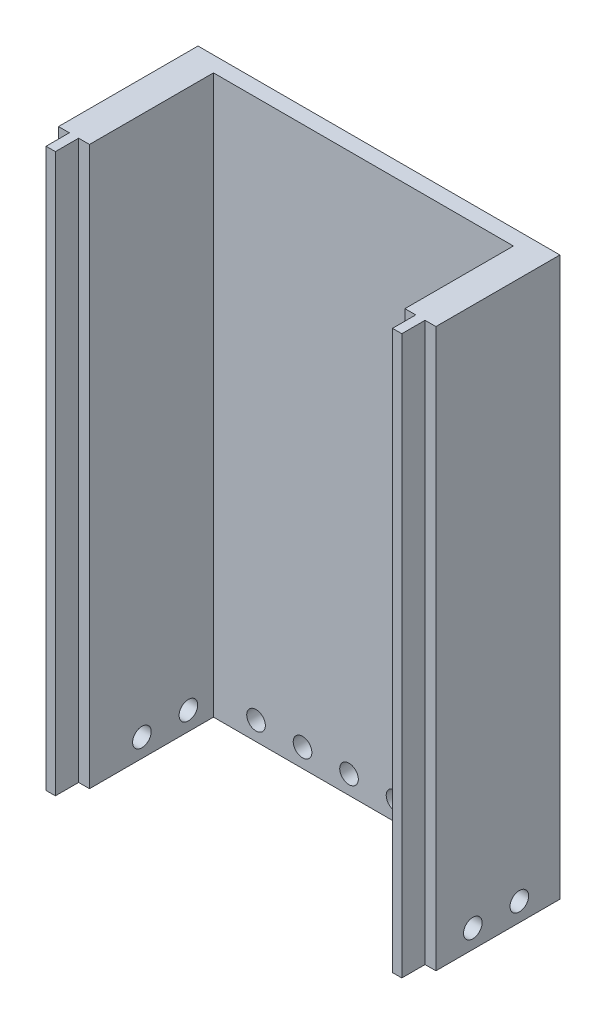
ISO-10303-21;
HEADER;
FILE_DESCRIPTION(('STEP AP214'),'2;1');
FILE_NAME('part.step','',(''),(''),'','','');
FILE_SCHEMA(('AUTOMOTIVE_DESIGN { 1 0 10303 214 1 1 1 1 }'));
ENDSEC;
DATA;
#1=APPLICATION_CONTEXT('core data for automotive mechanical design processes');
#2=APPLICATION_PROTOCOL_DEFINITION('international standard','automotive_design',2000,#1);
#3=PRODUCT_CONTEXT('',#1,'mechanical');
#4=PRODUCT('Part','Part','',(#3));
#5=PRODUCT_RELATED_PRODUCT_CATEGORY('part','',(#4));
#6=PRODUCT_DEFINITION_FORMATION('','',#4);
#7=PRODUCT_DEFINITION_CONTEXT('part definition',#1,'design');
#8=PRODUCT_DEFINITION('design','',#6,#7);
#9=PRODUCT_DEFINITION_SHAPE('','',#8);
#10=(LENGTH_UNIT() NAMED_UNIT(*) SI_UNIT(.MILLI.,.METRE.));
#11=(NAMED_UNIT(*) PLANE_ANGLE_UNIT() SI_UNIT($,.RADIAN.));
#12=(NAMED_UNIT(*) SI_UNIT($,.STERADIAN.) SOLID_ANGLE_UNIT());
#13=UNCERTAINTY_MEASURE_WITH_UNIT(LENGTH_MEASURE(1.E-05),#10,'distance_accuracy_value','');
#14=(GEOMETRIC_REPRESENTATION_CONTEXT(3) GLOBAL_UNCERTAINTY_ASSIGNED_CONTEXT((#13)) GLOBAL_UNIT_ASSIGNED_CONTEXT((#10,
#11,#12)) REPRESENTATION_CONTEXT('',''));
#15=CARTESIAN_POINT('',(0.,0.,0.));
#16=DIRECTION('',(0.,0.,1.));
#17=DIRECTION('',(1.,0.,0.));
#18=AXIS2_PLACEMENT_3D('',#15,#16,#17);
#19=CARTESIAN_POINT('',(-8.37229615598452,18.,12.1908698498439));
#20=DIRECTION('',(0.,0.,1.));
#21=DIRECTION('',(1.,0.,0.));
#22=AXIS2_PLACEMENT_3D('',#19,#20,#21);
#23=PLANE('',#22);
#24=CARTESIAN_POINT('',(-4.5,0.6,12.1908698498439));
#25=DIRECTION('',(0.,0.,1.));
#26=DIRECTION('',(1.,0.,0.));
#27=AXIS2_PLACEMENT_3D('',#24,#25,#26);
#28=CIRCLE('',#27,0.3);
#29=CARTESIAN_POINT('',(-4.2,0.6,12.1908698498439));
#30=VERTEX_POINT('',#29);
#31=EDGE_CURVE('E318',#30,#30,#28,.T.);
#32=ORIENTED_EDGE('',*,*,#31,.T.);
#33=EDGE_LOOP('',(#32));
#34=FACE_BOUND('',#33,.T.);
#35=CARTESIAN_POINT('',(-3.,0.6,12.1908698498439));
#36=DIRECTION('',(0.,0.,1.));
#37=DIRECTION('',(1.,0.,0.));
#38=AXIS2_PLACEMENT_3D('',#35,#36,#37);
#39=CIRCLE('',#38,0.3);
#40=CARTESIAN_POINT('',(-2.7,0.6,12.1908698498439));
#41=VERTEX_POINT('',#40);
#42=EDGE_CURVE('E322',#41,#41,#39,.T.);
#43=ORIENTED_EDGE('',*,*,#42,.T.);
#44=EDGE_LOOP('',(#43));
#45=FACE_BOUND('',#44,.T.);
#46=CARTESIAN_POINT('',(-1.5,0.6,12.1908698498439));
#47=DIRECTION('',(0.,0.,1.));
#48=DIRECTION('',(1.,0.,0.));
#49=AXIS2_PLACEMENT_3D('',#46,#47,#48);
#50=CIRCLE('',#49,0.3);
#51=CARTESIAN_POINT('',(-1.2,0.6,12.1908698498439));
#52=VERTEX_POINT('',#51);
#53=EDGE_CURVE('E326',#52,#52,#50,.T.);
#54=ORIENTED_EDGE('',*,*,#53,.T.);
#55=EDGE_LOOP('',(#54));
#56=FACE_BOUND('',#55,.T.);
#57=CARTESIAN_POINT('',(1.5,0.6,12.1908698498439));
#58=DIRECTION('',(0.,0.,1.));
#59=DIRECTION('',(1.,0.,0.));
#60=AXIS2_PLACEMENT_3D('',#57,#58,#59);
#61=CIRCLE('',#60,0.3);
#62=CARTESIAN_POINT('',(1.8,0.6,12.1908698498439));
#63=VERTEX_POINT('',#62);
#64=EDGE_CURVE('E330',#63,#63,#61,.T.);
#65=ORIENTED_EDGE('',*,*,#64,.T.);
#66=EDGE_LOOP('',(#65));
#67=FACE_BOUND('',#66,.T.);
#68=CARTESIAN_POINT('',(0.,0.6,12.1908698498439));
#69=DIRECTION('',(0.,0.,1.));
#70=DIRECTION('',(1.,0.,0.));
#71=AXIS2_PLACEMENT_3D('',#68,#69,#70);
#72=CIRCLE('',#71,0.3);
#73=CARTESIAN_POINT('',(0.3,0.6,12.1908698498439));
#74=VERTEX_POINT('',#73);
#75=EDGE_CURVE('E334',#74,#74,#72,.T.);
#76=ORIENTED_EDGE('',*,*,#75,.T.);
#77=EDGE_LOOP('',(#76));
#78=FACE_BOUND('',#77,.T.);
#79=CARTESIAN_POINT('',(-6.,0.6,12.1908698498439));
#80=DIRECTION('',(0.,0.,1.));
#81=DIRECTION('',(1.,0.,0.));
#82=AXIS2_PLACEMENT_3D('',#79,#80,#81);
#83=CIRCLE('',#82,0.3);
#84=CARTESIAN_POINT('',(-5.7,0.6,12.1908698498439));
#85=VERTEX_POINT('',#84);
#86=EDGE_CURVE('E181',#85,#85,#83,.T.);
#87=ORIENTED_EDGE('',*,*,#86,.T.);
#88=EDGE_LOOP('',(#87));
#89=FACE_BOUND('',#88,.T.);
#90=DIRECTION('',(-1.,0.,0.));
#91=VECTOR('',#90,1.);
#92=CARTESIAN_POINT('',(-8.37229615598452,0.,12.1908698498439));
#93=LINE('',#92,#91);
#94=CARTESIAN_POINT('',(3.30270384499531,0.,12.1908698498439));
#95=VERTEX_POINT('',#94);
#96=CARTESIAN_POINT('',(-8.37229615598452,0.,12.1908698498439));
#97=VERTEX_POINT('',#96);
#98=EDGE_CURVE('E177',#95,#97,#93,.T.);
#99=ORIENTED_EDGE('',*,*,#98,.T.);
#100=DIRECTION('',(0.,-1.,0.));
#101=VECTOR('',#100,1.);
#102=CARTESIAN_POINT('',(-8.37229615598452,18.,12.1908698498439));
#103=LINE('',#102,#101);
#104=CARTESIAN_POINT('',(-8.37229615598452,18.,12.1908698498439));
#105=VERTEX_POINT('',#104);
#106=EDGE_CURVE('E11',#105,#97,#103,.T.);
#107=ORIENTED_EDGE('',*,*,#106,.F.);
#108=DIRECTION('',(-1.,0.,0.));
#109=VECTOR('',#108,1.);
#110=CARTESIAN_POINT('',(-8.37229615598452,18.,12.1908698498439));
#111=LINE('',#110,#109);
#112=CARTESIAN_POINT('',(3.30270384499531,18.,12.1908698498439));
#113=VERTEX_POINT('',#112);
#114=EDGE_CURVE('E208',#113,#105,#111,.T.);
#115=ORIENTED_EDGE('',*,*,#114,.F.);
#116=DIRECTION('',(0.,-1.,0.));
#117=VECTOR('',#116,1.);
#118=CARTESIAN_POINT('',(3.30270384499531,18.,12.1908698498439));
#119=LINE('',#118,#117);
#120=EDGE_CURVE('E173',#113,#95,#119,.T.);
#121=ORIENTED_EDGE('',*,*,#120,.T.);
#122=EDGE_LOOP('',(#99,#107,#115,#121));
#123=FACE_BOUND('',#122,.T.);
#124=ADVANCED_FACE('F33',(#34,#45,#56,#67,#78,#89,#123),#23,.F.);
#125=CARTESIAN_POINT('',(-8.37229615598452,18.,12.1908698498439));
#126=DIRECTION('',(1.,0.,0.));
#127=DIRECTION('',(0.,0.,-1.));
#128=AXIS2_PLACEMENT_3D('',#125,#126,#127);
#129=PLANE('',#128);
#130=CARTESIAN_POINT('',(-8.37229615598452,0.6,13.5));
#131=DIRECTION('',(1.,0.,0.));
#132=DIRECTION('',(0.,0.,-1.));
#133=AXIS2_PLACEMENT_3D('',#130,#131,#132);
#134=CIRCLE('',#133,0.3);
#135=CARTESIAN_POINT('',(-8.37229615598452,0.6,13.2));
#136=VERTEX_POINT('',#135);
#137=EDGE_CURVE('E383',#136,#136,#134,.T.);
#138=ORIENTED_EDGE('',*,*,#137,.T.);
#139=EDGE_LOOP('',(#138));
#140=FACE_BOUND('',#139,.T.);
#141=CARTESIAN_POINT('',(-8.37229615598452,0.6,15.));
#142=DIRECTION('',(1.,0.,0.));
#143=DIRECTION('',(0.,0.,-1.));
#144=AXIS2_PLACEMENT_3D('',#141,#142,#143);
#145=CIRCLE('',#144,0.3);
#146=CARTESIAN_POINT('',(-8.37229615598452,0.6,14.7));
#147=VERTEX_POINT('',#146);
#148=EDGE_CURVE('E371',#147,#147,#145,.T.);
#149=ORIENTED_EDGE('',*,*,#148,.T.);
#150=EDGE_LOOP('',(#149));
#151=FACE_BOUND('',#150,.T.);
#152=DIRECTION('',(0.,0.,1.));
#153=VECTOR('',#152,1.);
#154=CARTESIAN_POINT('',(-8.37229615598452,0.,12.1908698498439));
#155=LINE('',#154,#153);
#156=CARTESIAN_POINT('',(-8.37229615598452,0.,16.6908698498439));
#157=VERTEX_POINT('',#156);
#158=EDGE_CURVE('E180',#97,#157,#155,.T.);
#159=ORIENTED_EDGE('',*,*,#158,.T.);
#160=DIRECTION('',(0.,-1.,0.));
#161=VECTOR('',#160,1.);
#162=CARTESIAN_POINT('',(-8.37229615598452,18.,16.6908698498439));
#163=LINE('',#162,#161);
#164=CARTESIAN_POINT('',(-8.37229615598452,18.,16.6908698498439));
#165=VERTEX_POINT('',#164);
#166=EDGE_CURVE('E41',#165,#157,#163,.T.);
#167=ORIENTED_EDGE('',*,*,#166,.F.);
#168=DIRECTION('',(0.,0.,1.));
#169=VECTOR('',#168,1.);
#170=CARTESIAN_POINT('',(-8.37229615598452,18.,12.1908698498439));
#171=LINE('',#170,#169);
#172=EDGE_CURVE('E116',#105,#165,#171,.T.);
#173=ORIENTED_EDGE('',*,*,#172,.F.);
#174=ORIENTED_EDGE('',*,*,#106,.T.);
#175=EDGE_LOOP('',(#159,#167,#173,#174));
#176=FACE_BOUND('',#175,.T.);
#177=ADVANCED_FACE('F309',(#140,#151,#176),#129,.F.);
#178=CARTESIAN_POINT('',(-8.37229615598452,18.,16.6908698498439));
#179=DIRECTION('',(0.,0.,-1.));
#180=DIRECTION('',(-1.,0.,0.));
#181=AXIS2_PLACEMENT_3D('',#178,#179,#180);
#182=PLANE('',#181);
#183=DIRECTION('',(1.,0.,0.));
#184=VECTOR('',#183,1.);
#185=CARTESIAN_POINT('',(-8.37229615598452,0.,16.6908698498439));
#186=LINE('',#185,#184);
#187=CARTESIAN_POINT('',(-8.02229615598452,0.,16.6908698498439));
#188=VERTEX_POINT('',#187);
#189=EDGE_CURVE('E183',#157,#188,#186,.T.);
#190=ORIENTED_EDGE('',*,*,#189,.T.);
#191=DIRECTION('',(0.,-1.,0.));
#192=VECTOR('',#191,1.);
#193=CARTESIAN_POINT('',(-8.02229615598452,18.,16.6908698498439));
#194=LINE('',#193,#192);
#195=CARTESIAN_POINT('',(-8.02229615598452,18.,16.6908698498439));
#196=VERTEX_POINT('',#195);
#197=EDGE_CURVE('E239',#196,#188,#194,.T.);
#198=ORIENTED_EDGE('',*,*,#197,.F.);
#199=DIRECTION('',(1.,0.,0.));
#200=VECTOR('',#199,1.);
#201=CARTESIAN_POINT('',(-8.37229615598452,18.,16.6908698498439));
#202=LINE('',#201,#200);
#203=EDGE_CURVE('E247',#165,#196,#202,.T.);
#204=ORIENTED_EDGE('',*,*,#203,.F.);
#205=ORIENTED_EDGE('',*,*,#166,.T.);
#206=EDGE_LOOP('',(#190,#198,#204,#205));
#207=FACE_BOUND('',#206,.T.);
#208=ADVANCED_FACE('F245',(#207),#182,.F.);
#209=CARTESIAN_POINT('',(-8.02229615598452,18.,16.6908698498439));
#210=DIRECTION('',(1.,0.,0.));
#211=DIRECTION('',(0.,0.,-1.));
#212=AXIS2_PLACEMENT_3D('',#209,#210,#211);
#213=PLANE('',#212);
#214=DIRECTION('',(0.,0.,1.));
#215=VECTOR('',#214,1.);
#216=CARTESIAN_POINT('',(-8.02229615598452,0.,16.6908698498439));
#217=LINE('',#216,#215);
#218=CARTESIAN_POINT('',(-8.02229615598452,0.,17.4408698498439));
#219=VERTEX_POINT('',#218);
#220=EDGE_CURVE('E185',#188,#219,#217,.T.);
#221=ORIENTED_EDGE('',*,*,#220,.T.);
#222=DIRECTION('',(0.,-1.,0.));
#223=VECTOR('',#222,1.);
#224=CARTESIAN_POINT('',(-8.02229615598452,18.,17.4408698498439));
#225=LINE('',#224,#223);
#226=CARTESIAN_POINT('',(-8.02229615598452,18.,17.4408698498439));
#227=VERTEX_POINT('',#226);
#228=EDGE_CURVE('E236',#227,#219,#225,.T.);
#229=ORIENTED_EDGE('',*,*,#228,.F.);
#230=DIRECTION('',(0.,0.,1.));
#231=VECTOR('',#230,1.);
#232=CARTESIAN_POINT('',(-8.02229615598452,18.,16.6908698498439));
#233=LINE('',#232,#231);
#234=EDGE_CURVE('E265',#196,#227,#233,.T.);
#235=ORIENTED_EDGE('',*,*,#234,.F.);
#236=ORIENTED_EDGE('',*,*,#197,.T.);
#237=EDGE_LOOP('',(#221,#229,#235,#236));
#238=FACE_BOUND('',#237,.T.);
#239=ADVANCED_FACE('F256',(#238),#213,.F.);
#240=CARTESIAN_POINT('',(-8.02229615598452,18.,17.4408698498439));
#241=DIRECTION('',(0.,0.,-1.));
#242=DIRECTION('',(-1.,0.,0.));
#243=AXIS2_PLACEMENT_3D('',#240,#241,#242);
#244=PLANE('',#243);
#245=DIRECTION('',(1.,0.,0.));
#246=VECTOR('',#245,1.);
#247=CARTESIAN_POINT('',(-8.02229615598452,0.,17.4408698498439));
#248=LINE('',#247,#246);
#249=CARTESIAN_POINT('',(-7.72229615598452,0.,17.4408698498439));
#250=VERTEX_POINT('',#249);
#251=EDGE_CURVE('E187',#219,#250,#248,.T.);
#252=ORIENTED_EDGE('',*,*,#251,.T.);
#253=DIRECTION('',(0.,-1.,0.));
#254=VECTOR('',#253,1.);
#255=CARTESIAN_POINT('',(-7.72229615598452,18.,17.4408698498439));
#256=LINE('',#255,#254);
#257=CARTESIAN_POINT('',(-7.72229615598452,18.,17.4408698498439));
#258=VERTEX_POINT('',#257);
#259=EDGE_CURVE('E233',#258,#250,#256,.T.);
#260=ORIENTED_EDGE('',*,*,#259,.F.);
#261=DIRECTION('',(1.,0.,0.));
#262=VECTOR('',#261,1.);
#263=CARTESIAN_POINT('',(-8.02229615598452,18.,17.4408698498439));
#264=LINE('',#263,#262);
#265=EDGE_CURVE('E262',#227,#258,#264,.T.);
#266=ORIENTED_EDGE('',*,*,#265,.F.);
#267=ORIENTED_EDGE('',*,*,#228,.T.);
#268=EDGE_LOOP('',(#252,#260,#266,#267));
#269=FACE_BOUND('',#268,.T.);
#270=ADVANCED_FACE('F260',(#269),#244,.F.);
#271=CARTESIAN_POINT('',(-7.72229615598452,18.,17.4408698498439));
#272=DIRECTION('',(-1.,0.,0.));
#273=DIRECTION('',(0.,0.,1.));
#274=AXIS2_PLACEMENT_3D('',#271,#272,#273);
#275=PLANE('',#274);
#276=DIRECTION('',(0.,0.,-1.));
#277=VECTOR('',#276,1.);
#278=CARTESIAN_POINT('',(-7.72229615598452,0.,17.4408698498439));
#279=LINE('',#278,#277);
#280=CARTESIAN_POINT('',(-7.72229615598452,0.,16.6908698498439));
#281=VERTEX_POINT('',#280);
#282=EDGE_CURVE('E189',#250,#281,#279,.T.);
#283=ORIENTED_EDGE('',*,*,#282,.T.);
#284=DIRECTION('',(0.,-1.,0.));
#285=VECTOR('',#284,1.);
#286=CARTESIAN_POINT('',(-7.72229615598452,18.,16.6908698498439));
#287=LINE('',#286,#285);
#288=CARTESIAN_POINT('',(-7.72229615598452,18.,16.6908698498439));
#289=VERTEX_POINT('',#288);
#290=EDGE_CURVE('E230',#289,#281,#287,.T.);
#291=ORIENTED_EDGE('',*,*,#290,.F.);
#292=DIRECTION('',(0.,0.,-1.));
#293=VECTOR('',#292,1.);
#294=CARTESIAN_POINT('',(-7.72229615598452,18.,17.4408698498439));
#295=LINE('',#294,#293);
#296=EDGE_CURVE('E264',#258,#289,#295,.T.);
#297=ORIENTED_EDGE('',*,*,#296,.F.);
#298=ORIENTED_EDGE('',*,*,#259,.T.);
#299=EDGE_LOOP('',(#283,#291,#297,#298));
#300=FACE_BOUND('',#299,.T.);
#301=ADVANCED_FACE('F439',(#300),#275,.F.);
#302=CARTESIAN_POINT('',(-7.72229615598452,18.,16.6908698498439));
#303=DIRECTION('',(0.,0.,-1.));
#304=DIRECTION('',(-1.,0.,0.));
#305=AXIS2_PLACEMENT_3D('',#302,#303,#304);
#306=PLANE('',#305);
#307=DIRECTION('',(1.,0.,0.));
#308=VECTOR('',#307,1.);
#309=CARTESIAN_POINT('',(-7.72229615598452,0.,16.6908698498439));
#310=LINE('',#309,#308);
#311=CARTESIAN_POINT('',(-7.37229615598452,0.,16.6908698498439));
#312=VERTEX_POINT('',#311);
#313=EDGE_CURVE('E191',#281,#312,#310,.T.);
#314=ORIENTED_EDGE('',*,*,#313,.T.);
#315=DIRECTION('',(0.,-1.,0.));
#316=VECTOR('',#315,1.);
#317=CARTESIAN_POINT('',(-7.37229615598452,18.,16.6908698498439));
#318=LINE('',#317,#316);
#319=CARTESIAN_POINT('',(-7.37229615598452,18.,16.6908698498439));
#320=VERTEX_POINT('',#319);
#321=EDGE_CURVE('E227',#320,#312,#318,.T.);
#322=ORIENTED_EDGE('',*,*,#321,.F.);
#323=DIRECTION('',(1.,0.,0.));
#324=VECTOR('',#323,1.);
#325=CARTESIAN_POINT('',(-7.72229615598452,18.,16.6908698498439));
#326=LINE('',#325,#324);
#327=EDGE_CURVE('E267',#289,#320,#326,.T.);
#328=ORIENTED_EDGE('',*,*,#327,.F.);
#329=ORIENTED_EDGE('',*,*,#290,.T.);
#330=EDGE_LOOP('',(#314,#322,#328,#329));
#331=FACE_BOUND('',#330,.T.);
#332=ADVANCED_FACE('F402',(#331),#306,.F.);
#333=CARTESIAN_POINT('',(-7.37229615598452,18.,16.6908698498439));
#334=DIRECTION('',(-1.,0.,0.));
#335=DIRECTION('',(0.,0.,1.));
#336=AXIS2_PLACEMENT_3D('',#333,#334,#335);
#337=PLANE('',#336);
#338=CARTESIAN_POINT('',(-7.37229615598452,0.6,13.5));
#339=DIRECTION('',(-1.,0.,0.));
#340=DIRECTION('',(0.,0.,1.));
#341=AXIS2_PLACEMENT_3D('',#338,#339,#340);
#342=CIRCLE('',#341,0.3);
#343=CARTESIAN_POINT('',(-7.37229615598452,0.6,13.8));
#344=VERTEX_POINT('',#343);
#345=EDGE_CURVE('E375',#344,#344,#342,.T.);
#346=ORIENTED_EDGE('',*,*,#345,.T.);
#347=EDGE_LOOP('',(#346));
#348=FACE_BOUND('',#347,.T.);
#349=CARTESIAN_POINT('',(-7.37229615598452,0.6,15.));
#350=DIRECTION('',(-1.,0.,0.));
#351=DIRECTION('',(0.,0.,1.));
#352=AXIS2_PLACEMENT_3D('',#349,#350,#351);
#353=CIRCLE('',#352,0.3);
#354=CARTESIAN_POINT('',(-7.37229615598452,0.6,15.3));
#355=VERTEX_POINT('',#354);
#356=EDGE_CURVE('E348',#355,#355,#353,.T.);
#357=ORIENTED_EDGE('',*,*,#356,.T.);
#358=EDGE_LOOP('',(#357));
#359=FACE_BOUND('',#358,.T.);
#360=DIRECTION('',(0.,0.,-1.));
#361=VECTOR('',#360,1.);
#362=CARTESIAN_POINT('',(-7.37229615598452,0.,16.6908698498439));
#363=LINE('',#362,#361);
#364=CARTESIAN_POINT('',(-7.37229615598452,0.,12.6908698498439));
#365=VERTEX_POINT('',#364);
#366=EDGE_CURVE('E193',#312,#365,#363,.T.);
#367=ORIENTED_EDGE('',*,*,#366,.T.);
#368=DIRECTION('',(0.,-1.,0.));
#369=VECTOR('',#368,1.);
#370=CARTESIAN_POINT('',(-7.37229615598452,18.,12.6908698498439));
#371=LINE('',#370,#369);
#372=CARTESIAN_POINT('',(-7.37229615598452,18.,12.6908698498439));
#373=VERTEX_POINT('',#372);
#374=EDGE_CURVE('E224',#373,#365,#371,.T.);
#375=ORIENTED_EDGE('',*,*,#374,.F.);
#376=DIRECTION('',(0.,0.,-1.));
#377=VECTOR('',#376,1.);
#378=CARTESIAN_POINT('',(-7.37229615598452,18.,16.6908698498439));
#379=LINE('',#378,#377);
#380=EDGE_CURVE('E273',#320,#373,#379,.T.);
#381=ORIENTED_EDGE('',*,*,#380,.F.);
#382=ORIENTED_EDGE('',*,*,#321,.T.);
#383=EDGE_LOOP('',(#367,#375,#381,#382));
#384=FACE_BOUND('',#383,.T.);
#385=ADVANCED_FACE('F398',(#348,#359,#384),#337,.F.);
#386=CARTESIAN_POINT('',(-7.37229615598452,18.,12.6908698498439));
#387=DIRECTION('',(0.,0.,-1.));
#388=DIRECTION('',(-1.,0.,0.));
#389=AXIS2_PLACEMENT_3D('',#386,#387,#388);
#390=PLANE('',#389);
#391=CARTESIAN_POINT('',(-4.5,0.6,12.6908698498439));
#392=DIRECTION('',(0.,0.,1.));
#393=DIRECTION('',(1.,0.,0.));
#394=AXIS2_PLACEMENT_3D('',#391,#392,#393);
#395=CIRCLE('',#394,0.3);
#396=CARTESIAN_POINT('',(-4.2,0.6,12.6908698498439));
#397=VERTEX_POINT('',#396);
#398=EDGE_CURVE('E362',#397,#397,#395,.T.);
#399=ORIENTED_EDGE('',*,*,#398,.F.);
#400=EDGE_LOOP('',(#399));
#401=FACE_BOUND('',#400,.T.);
#402=CARTESIAN_POINT('',(-3.,0.6,12.6908698498439));
#403=DIRECTION('',(0.,0.,1.));
#404=DIRECTION('',(1.,0.,0.));
#405=AXIS2_PLACEMENT_3D('',#402,#403,#404);
#406=CIRCLE('',#405,0.3);
#407=CARTESIAN_POINT('',(-2.7,0.6,12.6908698498439));
#408=VERTEX_POINT('',#407);
#409=EDGE_CURVE('E358',#408,#408,#406,.T.);
#410=ORIENTED_EDGE('',*,*,#409,.F.);
#411=EDGE_LOOP('',(#410));
#412=FACE_BOUND('',#411,.T.);
#413=CARTESIAN_POINT('',(-1.5,0.6,12.6908698498439));
#414=DIRECTION('',(0.,0.,1.));
#415=DIRECTION('',(1.,0.,0.));
#416=AXIS2_PLACEMENT_3D('',#413,#414,#415);
#417=CIRCLE('',#416,0.3);
#418=CARTESIAN_POINT('',(-1.2,0.6,12.6908698498439));
#419=VERTEX_POINT('',#418);
#420=EDGE_CURVE('E354',#419,#419,#417,.T.);
#421=ORIENTED_EDGE('',*,*,#420,.F.);
#422=EDGE_LOOP('',(#421));
#423=FACE_BOUND('',#422,.T.);
#424=CARTESIAN_POINT('',(1.5,0.6,12.6908698498439));
#425=DIRECTION('',(0.,0.,1.));
#426=DIRECTION('',(1.,0.,0.));
#427=AXIS2_PLACEMENT_3D('',#424,#425,#426);
#428=CIRCLE('',#427,0.3);
#429=CARTESIAN_POINT('',(1.8,0.6,12.6908698498439));
#430=VERTEX_POINT('',#429);
#431=EDGE_CURVE('E350',#430,#430,#428,.T.);
#432=ORIENTED_EDGE('',*,*,#431,.F.);
#433=EDGE_LOOP('',(#432));
#434=FACE_BOUND('',#433,.T.);
#435=CARTESIAN_POINT('',(0.,0.6,12.6908698498439));
#436=DIRECTION('',(0.,0.,1.));
#437=DIRECTION('',(1.,0.,0.));
#438=AXIS2_PLACEMENT_3D('',#435,#436,#437);
#439=CIRCLE('',#438,0.3);
#440=CARTESIAN_POINT('',(0.3,0.6,12.6908698498439));
#441=VERTEX_POINT('',#440);
#442=EDGE_CURVE('E343',#441,#441,#439,.T.);
#443=ORIENTED_EDGE('',*,*,#442,.F.);
#444=EDGE_LOOP('',(#443));
#445=FACE_BOUND('',#444,.T.);
#446=CARTESIAN_POINT('',(-6.,0.6,12.6908698498439));
#447=DIRECTION('',(0.,0.,1.));
#448=DIRECTION('',(1.,0.,0.));
#449=AXIS2_PLACEMENT_3D('',#446,#447,#448);
#450=CIRCLE('',#449,0.3);
#451=CARTESIAN_POINT('',(-5.7,0.6,12.6908698498439));
#452=VERTEX_POINT('',#451);
#453=EDGE_CURVE('E338',#452,#452,#450,.T.);
#454=ORIENTED_EDGE('',*,*,#453,.F.);
#455=EDGE_LOOP('',(#454));
#456=FACE_BOUND('',#455,.T.);
#457=DIRECTION('',(1.,0.,0.));
#458=VECTOR('',#457,1.);
#459=CARTESIAN_POINT('',(-7.37229615598452,0.,12.6908698498439));
#460=LINE('',#459,#458);
#461=CARTESIAN_POINT('',(2.30270384499531,0.,12.6908698498439));
#462=VERTEX_POINT('',#461);
#463=EDGE_CURVE('E195',#365,#462,#460,.T.);
#464=ORIENTED_EDGE('',*,*,#463,.T.);
#465=DIRECTION('',(0.,-1.,0.));
#466=VECTOR('',#465,1.);
#467=CARTESIAN_POINT('',(2.30270384499531,18.,12.6908698498439));
#468=LINE('',#467,#466);
#469=CARTESIAN_POINT('',(2.30270384499531,18.,12.6908698498439));
#470=VERTEX_POINT('',#469);
#471=EDGE_CURVE('E221',#470,#462,#468,.T.);
#472=ORIENTED_EDGE('',*,*,#471,.F.);
#473=DIRECTION('',(1.,0.,0.));
#474=VECTOR('',#473,1.);
#475=CARTESIAN_POINT('',(-7.37229615598452,18.,12.6908698498439));
#476=LINE('',#475,#474);
#477=EDGE_CURVE('E275',#373,#470,#476,.T.);
#478=ORIENTED_EDGE('',*,*,#477,.F.);
#479=ORIENTED_EDGE('',*,*,#374,.T.);
#480=EDGE_LOOP('',(#464,#472,#478,#479));
#481=FACE_BOUND('',#480,.T.);
#482=ADVANCED_FACE('F401',(#401,#412,#423,#434,#445,#456,#481),#390,.F.);
#483=CARTESIAN_POINT('',(2.30270384499531,18.,12.6908698498439));
#484=DIRECTION('',(1.,0.,0.));
#485=DIRECTION('',(0.,0.,-1.));
#486=AXIS2_PLACEMENT_3D('',#483,#484,#485);
#487=PLANE('',#486);
#488=CARTESIAN_POINT('',(2.30270384499531,0.6,13.5));
#489=DIRECTION('',(1.,0.,0.));
#490=DIRECTION('',(0.,0.,-1.));
#491=AXIS2_PLACEMENT_3D('',#488,#489,#490);
#492=CIRCLE('',#491,0.3);
#493=CARTESIAN_POINT('',(2.30270384499531,0.6,13.2));
#494=VERTEX_POINT('',#493);
#495=EDGE_CURVE('E380',#494,#494,#492,.T.);
#496=ORIENTED_EDGE('',*,*,#495,.T.);
#497=EDGE_LOOP('',(#496));
#498=FACE_BOUND('',#497,.T.);
#499=CARTESIAN_POINT('',(2.30270384499531,0.6,15.));
#500=DIRECTION('',(1.,0.,0.));
#501=DIRECTION('',(0.,0.,-1.));
#502=AXIS2_PLACEMENT_3D('',#499,#500,#501);
#503=CIRCLE('',#502,0.3);
#504=CARTESIAN_POINT('',(2.30270384499531,0.6,14.7));
#505=VERTEX_POINT('',#504);
#506=EDGE_CURVE('E368',#505,#505,#503,.T.);
#507=ORIENTED_EDGE('',*,*,#506,.T.);
#508=EDGE_LOOP('',(#507));
#509=FACE_BOUND('',#508,.T.);
#510=DIRECTION('',(0.,0.,1.));
#511=VECTOR('',#510,1.);
#512=CARTESIAN_POINT('',(2.30270384499531,0.,12.6908698498439));
#513=LINE('',#512,#511);
#514=CARTESIAN_POINT('',(2.30270384499531,0.,16.1908698498439));
#515=VERTEX_POINT('',#514);
#516=EDGE_CURVE('E197',#462,#515,#513,.T.);
#517=ORIENTED_EDGE('',*,*,#516,.T.);
#518=DIRECTION('',(0.,-1.,0.));
#519=VECTOR('',#518,1.);
#520=CARTESIAN_POINT('',(2.30270384499531,18.,16.1908698498439));
#521=LINE('',#520,#519);
#522=CARTESIAN_POINT('',(2.30270384499531,18.,16.1908698498439));
#523=VERTEX_POINT('',#522);
#524=EDGE_CURVE('E218',#523,#515,#521,.T.);
#525=ORIENTED_EDGE('',*,*,#524,.F.);
#526=DIRECTION('',(0.,0.,1.));
#527=VECTOR('',#526,1.);
#528=CARTESIAN_POINT('',(2.30270384499531,18.,12.6908698498439));
#529=LINE('',#528,#527);
#530=EDGE_CURVE('E277',#470,#523,#529,.T.);
#531=ORIENTED_EDGE('',*,*,#530,.F.);
#532=ORIENTED_EDGE('',*,*,#471,.T.);
#533=EDGE_LOOP('',(#517,#525,#531,#532));
#534=FACE_BOUND('',#533,.T.);
#535=ADVANCED_FACE('F419',(#498,#509,#534),#487,.F.);
#536=CARTESIAN_POINT('',(2.30270384499531,18.,16.1908698498439));
#537=DIRECTION('',(0.,0.,-1.));
#538=DIRECTION('',(-1.,0.,0.));
#539=AXIS2_PLACEMENT_3D('',#536,#537,#538);
#540=PLANE('',#539);
#541=DIRECTION('',(1.,0.,0.));
#542=VECTOR('',#541,1.);
#543=CARTESIAN_POINT('',(2.30270384499531,0.,16.1908698498439));
#544=LINE('',#543,#542);
#545=CARTESIAN_POINT('',(2.65270384499531,0.,16.1908698498439));
#546=VERTEX_POINT('',#545);
#547=EDGE_CURVE('E199',#515,#546,#544,.T.);
#548=ORIENTED_EDGE('',*,*,#547,.T.);
#549=DIRECTION('',(0.,-1.,0.));
#550=VECTOR('',#549,1.);
#551=CARTESIAN_POINT('',(2.65270384499531,18.,16.1908698498439));
#552=LINE('',#551,#550);
#553=CARTESIAN_POINT('',(2.65270384499531,18.,16.1908698498439));
#554=VERTEX_POINT('',#553);
#555=EDGE_CURVE('E215',#554,#546,#552,.T.);
#556=ORIENTED_EDGE('',*,*,#555,.F.);
#557=DIRECTION('',(1.,0.,0.));
#558=VECTOR('',#557,1.);
#559=CARTESIAN_POINT('',(2.30270384499531,18.,16.1908698498439));
#560=LINE('',#559,#558);
#561=EDGE_CURVE('E279',#523,#554,#560,.T.);
#562=ORIENTED_EDGE('',*,*,#561,.F.);
#563=ORIENTED_EDGE('',*,*,#524,.T.);
#564=EDGE_LOOP('',(#548,#556,#562,#563));
#565=FACE_BOUND('',#564,.T.);
#566=ADVANCED_FACE('F422',(#565),#540,.F.);
#567=CARTESIAN_POINT('',(2.65270384499531,18.,16.1908698498439));
#568=DIRECTION('',(1.,0.,0.));
#569=DIRECTION('',(0.,0.,-1.));
#570=AXIS2_PLACEMENT_3D('',#567,#568,#569);
#571=PLANE('',#570);
#572=DIRECTION('',(0.,0.,1.));
#573=VECTOR('',#572,1.);
#574=CARTESIAN_POINT('',(2.65270384499531,0.,16.1908698498439));
#575=LINE('',#574,#573);
#576=CARTESIAN_POINT('',(2.65270384499531,0.,16.9408698498439));
#577=VERTEX_POINT('',#576);
#578=EDGE_CURVE('E201',#546,#577,#575,.T.);
#579=ORIENTED_EDGE('',*,*,#578,.T.);
#580=DIRECTION('',(0.,-1.,0.));
#581=VECTOR('',#580,1.);
#582=CARTESIAN_POINT('',(2.65270384499531,18.,16.9408698498439));
#583=LINE('',#582,#581);
#584=CARTESIAN_POINT('',(2.65270384499531,18.,16.9408698498439));
#585=VERTEX_POINT('',#584);
#586=EDGE_CURVE('E212',#585,#577,#583,.T.);
#587=ORIENTED_EDGE('',*,*,#586,.F.);
#588=DIRECTION('',(0.,0.,1.));
#589=VECTOR('',#588,1.);
#590=CARTESIAN_POINT('',(2.65270384499531,18.,16.1908698498439));
#591=LINE('',#590,#589);
#592=EDGE_CURVE('E281',#554,#585,#591,.T.);
#593=ORIENTED_EDGE('',*,*,#592,.F.);
#594=ORIENTED_EDGE('',*,*,#555,.T.);
#595=EDGE_LOOP('',(#579,#587,#593,#594));
#596=FACE_BOUND('',#595,.T.);
#597=ADVANCED_FACE('F287',(#596),#571,.F.);
#598=CARTESIAN_POINT('',(2.65270384499531,18.,16.9408698498439));
#599=DIRECTION('',(0.,0.,-1.));
#600=DIRECTION('',(-1.,0.,0.));
#601=AXIS2_PLACEMENT_3D('',#598,#599,#600);
#602=PLANE('',#601);
#603=DIRECTION('',(1.,0.,0.));
#604=VECTOR('',#603,1.);
#605=CARTESIAN_POINT('',(2.65270384499531,0.,16.9408698498439));
#606=LINE('',#605,#604);
#607=CARTESIAN_POINT('',(2.95270384499531,0.,16.9408698498439));
#608=VERTEX_POINT('',#607);
#609=EDGE_CURVE('E203',#577,#608,#606,.T.);
#610=ORIENTED_EDGE('',*,*,#609,.T.);
#611=DIRECTION('',(0.,-1.,0.));
#612=VECTOR('',#611,1.);
#613=CARTESIAN_POINT('',(2.95270384499531,18.,16.9408698498439));
#614=LINE('',#613,#612);
#615=CARTESIAN_POINT('',(2.95270384499531,18.,16.9408698498439));
#616=VERTEX_POINT('',#615);
#617=EDGE_CURVE('E168',#616,#608,#614,.T.);
#618=ORIENTED_EDGE('',*,*,#617,.F.);
#619=DIRECTION('',(1.,0.,0.));
#620=VECTOR('',#619,1.);
#621=CARTESIAN_POINT('',(2.65270384499531,18.,16.9408698498439));
#622=LINE('',#621,#620);
#623=EDGE_CURVE('E159',#585,#616,#622,.T.);
#624=ORIENTED_EDGE('',*,*,#623,.F.);
#625=ORIENTED_EDGE('',*,*,#586,.T.);
#626=EDGE_LOOP('',(#610,#618,#624,#625));
#627=FACE_BOUND('',#626,.T.);
#628=ADVANCED_FACE('F291',(#627),#602,.F.);
#629=CARTESIAN_POINT('',(2.95270384499531,18.,16.9408698498439));
#630=DIRECTION('',(-1.,0.,0.));
#631=DIRECTION('',(0.,0.,1.));
#632=AXIS2_PLACEMENT_3D('',#629,#630,#631);
#633=PLANE('',#632);
#634=DIRECTION('',(0.,0.,-1.));
#635=VECTOR('',#634,1.);
#636=CARTESIAN_POINT('',(2.95270384499531,0.,16.9408698498439));
#637=LINE('',#636,#635);
#638=CARTESIAN_POINT('',(2.95270384499531,0.,16.1908698498439));
#639=VERTEX_POINT('',#638);
#640=EDGE_CURVE('E167',#608,#639,#637,.T.);
#641=ORIENTED_EDGE('',*,*,#640,.T.);
#642=DIRECTION('',(0.,-1.,0.));
#643=VECTOR('',#642,1.);
#644=CARTESIAN_POINT('',(2.95270384499531,18.,16.1908698498439));
#645=LINE('',#644,#643);
#646=CARTESIAN_POINT('',(2.95270384499531,18.,16.1908698498439));
#647=VERTEX_POINT('',#646);
#648=EDGE_CURVE('E164',#647,#639,#645,.T.);
#649=ORIENTED_EDGE('',*,*,#648,.F.);
#650=DIRECTION('',(0.,0.,-1.));
#651=VECTOR('',#650,1.);
#652=CARTESIAN_POINT('',(2.95270384499531,18.,16.9408698498439));
#653=LINE('',#652,#651);
#654=EDGE_CURVE('E153',#616,#647,#653,.T.);
#655=ORIENTED_EDGE('',*,*,#654,.F.);
#656=ORIENTED_EDGE('',*,*,#617,.T.);
#657=EDGE_LOOP('',(#641,#649,#655,#656));
#658=FACE_BOUND('',#657,.T.);
#659=ADVANCED_FACE('F165',(#658),#633,.F.);
#660=CARTESIAN_POINT('',(2.95270384499531,18.,16.1908698498439));
#661=DIRECTION('',(0.,0.,-1.));
#662=DIRECTION('',(-1.,0.,0.));
#663=AXIS2_PLACEMENT_3D('',#660,#661,#662);
#664=PLANE('',#663);
#665=DIRECTION('',(1.,0.,0.));
#666=VECTOR('',#665,1.);
#667=CARTESIAN_POINT('',(2.95270384499531,0.,16.1908698498439));
#668=LINE('',#667,#666);
#669=CARTESIAN_POINT('',(3.30270384499531,0.,16.1908698498439));
#670=VERTEX_POINT('',#669);
#671=EDGE_CURVE('E102',#639,#670,#668,.T.);
#672=ORIENTED_EDGE('',*,*,#671,.T.);
#673=DIRECTION('',(0.,-1.,0.));
#674=VECTOR('',#673,1.);
#675=CARTESIAN_POINT('',(3.30270384499531,18.,16.1908698498439));
#676=LINE('',#675,#674);
#677=CARTESIAN_POINT('',(3.30270384499531,18.,16.1908698498439));
#678=VERTEX_POINT('',#677);
#679=EDGE_CURVE('E169',#678,#670,#676,.T.);
#680=ORIENTED_EDGE('',*,*,#679,.F.);
#681=DIRECTION('',(1.,0.,0.));
#682=VECTOR('',#681,1.);
#683=CARTESIAN_POINT('',(2.95270384499531,18.,16.1908698498439));
#684=LINE('',#683,#682);
#685=EDGE_CURVE('E157',#647,#678,#684,.T.);
#686=ORIENTED_EDGE('',*,*,#685,.F.);
#687=ORIENTED_EDGE('',*,*,#648,.T.);
#688=EDGE_LOOP('',(#672,#680,#686,#687));
#689=FACE_BOUND('',#688,.T.);
#690=ADVANCED_FACE('F171',(#689),#664,.F.);
#691=CARTESIAN_POINT('',(3.30270384499531,18.,16.1908698498439));
#692=DIRECTION('',(-1.,0.,0.));
#693=DIRECTION('',(0.,0.,1.));
#694=AXIS2_PLACEMENT_3D('',#691,#692,#693);
#695=PLANE('',#694);
#696=CARTESIAN_POINT('',(3.30270384499531,0.6,13.5));
#697=DIRECTION('',(1.,0.,0.));
#698=DIRECTION('',(0.,0.,-1.));
#699=AXIS2_PLACEMENT_3D('',#696,#697,#698);
#700=CIRCLE('',#699,0.3);
#701=CARTESIAN_POINT('',(3.30270384499531,0.6,13.2));
#702=VERTEX_POINT('',#701);
#703=EDGE_CURVE('E384',#702,#702,#700,.T.);
#704=ORIENTED_EDGE('',*,*,#703,.F.);
#705=EDGE_LOOP('',(#704));
#706=FACE_BOUND('',#705,.T.);
#707=CARTESIAN_POINT('',(3.30270384499531,0.6,15.));
#708=DIRECTION('',(1.,0.,0.));
#709=DIRECTION('',(0.,0.,-1.));
#710=AXIS2_PLACEMENT_3D('',#707,#708,#709);
#711=CIRCLE('',#710,0.3);
#712=CARTESIAN_POINT('',(3.30270384499531,0.6,14.7));
#713=VERTEX_POINT('',#712);
#714=EDGE_CURVE('E372',#713,#713,#711,.T.);
#715=ORIENTED_EDGE('',*,*,#714,.F.);
#716=EDGE_LOOP('',(#715));
#717=FACE_BOUND('',#716,.T.);
#718=DIRECTION('',(0.,0.,-1.));
#719=VECTOR('',#718,1.);
#720=CARTESIAN_POINT('',(3.30270384499531,0.,16.1908698498439));
#721=LINE('',#720,#719);
#722=EDGE_CURVE('E108',#670,#95,#721,.T.);
#723=ORIENTED_EDGE('',*,*,#722,.T.);
#724=ORIENTED_EDGE('',*,*,#120,.F.);
#725=DIRECTION('',(0.,0.,-1.));
#726=VECTOR('',#725,1.);
#727=CARTESIAN_POINT('',(3.30270384499531,18.,16.1908698498439));
#728=LINE('',#727,#726);
#729=EDGE_CURVE('E49',#678,#113,#728,.T.);
#730=ORIENTED_EDGE('',*,*,#729,.F.);
#731=ORIENTED_EDGE('',*,*,#679,.T.);
#732=EDGE_LOOP('',(#723,#724,#730,#731));
#733=FACE_BOUND('',#732,.T.);
#734=ADVANCED_FACE('F295',(#706,#717,#733),#695,.F.);
#735=CARTESIAN_POINT('',(0.,18.,0.));
#736=DIRECTION('',(0.,1.,0.));
#737=DIRECTION('',(0.,0.,1.));
#738=AXIS2_PLACEMENT_3D('',#735,#736,#737);
#739=PLANE('',#738);
#740=ORIENTED_EDGE('',*,*,#114,.T.);
#741=ORIENTED_EDGE('',*,*,#172,.T.);
#742=ORIENTED_EDGE('',*,*,#203,.T.);
#743=ORIENTED_EDGE('',*,*,#234,.T.);
#744=ORIENTED_EDGE('',*,*,#265,.T.);
#745=ORIENTED_EDGE('',*,*,#296,.T.);
#746=ORIENTED_EDGE('',*,*,#327,.T.);
#747=ORIENTED_EDGE('',*,*,#380,.T.);
#748=ORIENTED_EDGE('',*,*,#477,.T.);
#749=ORIENTED_EDGE('',*,*,#530,.T.);
#750=ORIENTED_EDGE('',*,*,#561,.T.);
#751=ORIENTED_EDGE('',*,*,#592,.T.);
#752=ORIENTED_EDGE('',*,*,#623,.T.);
#753=ORIENTED_EDGE('',*,*,#654,.T.);
#754=ORIENTED_EDGE('',*,*,#685,.T.);
#755=ORIENTED_EDGE('',*,*,#729,.T.);
#756=EDGE_LOOP('',(#740,#741,#742,#743,#744,#745,#746,#747,#748,#749,#750,#751,#752,#753,#754,#755));
#757=FACE_BOUND('',#756,.T.);
#758=ADVANCED_FACE('F155',(#757),#739,.T.);
#759=CARTESIAN_POINT('',(0.,0.,0.));
#760=DIRECTION('',(0.,1.,0.));
#761=DIRECTION('',(0.,0.,1.));
#762=AXIS2_PLACEMENT_3D('',#759,#760,#761);
#763=PLANE('',#762);
#764=ORIENTED_EDGE('',*,*,#98,.F.);
#765=ORIENTED_EDGE('',*,*,#722,.F.);
#766=ORIENTED_EDGE('',*,*,#671,.F.);
#767=ORIENTED_EDGE('',*,*,#640,.F.);
#768=ORIENTED_EDGE('',*,*,#609,.F.);
#769=ORIENTED_EDGE('',*,*,#578,.F.);
#770=ORIENTED_EDGE('',*,*,#547,.F.);
#771=ORIENTED_EDGE('',*,*,#516,.F.);
#772=ORIENTED_EDGE('',*,*,#463,.F.);
#773=ORIENTED_EDGE('',*,*,#366,.F.);
#774=ORIENTED_EDGE('',*,*,#313,.F.);
#775=ORIENTED_EDGE('',*,*,#282,.F.);
#776=ORIENTED_EDGE('',*,*,#251,.F.);
#777=ORIENTED_EDGE('',*,*,#220,.F.);
#778=ORIENTED_EDGE('',*,*,#189,.F.);
#779=ORIENTED_EDGE('',*,*,#158,.F.);
#780=EDGE_LOOP('',(#764,#765,#766,#767,#768,#769,#770,#771,#772,#773,#774,#775,#776,#777,#778,#779));
#781=FACE_BOUND('',#780,.T.);
#782=ADVANCED_FACE('F251',(#781),#763,.F.);
#783=CARTESIAN_POINT('',(-6.,0.6,12.1908698498439));
#784=DIRECTION('',(0.,0.,1.));
#785=DIRECTION('',(1.,0.,0.));
#786=AXIS2_PLACEMENT_3D('',#783,#784,#785);
#787=CYLINDRICAL_SURFACE('',#786,0.3);
#788=ORIENTED_EDGE('',*,*,#86,.F.);
#789=EDGE_LOOP('',(#788));
#790=FACE_BOUND('',#789,.T.);
#791=ORIENTED_EDGE('',*,*,#453,.T.);
#792=EDGE_LOOP('',(#791));
#793=FACE_BOUND('',#792,.T.);
#794=ADVANCED_FACE('F548',(#790,#793),#787,.F.);
#795=CARTESIAN_POINT('',(0.,0.6,12.1908698498439));
#796=DIRECTION('',(0.,0.,1.));
#797=DIRECTION('',(1.,0.,0.));
#798=AXIS2_PLACEMENT_3D('',#795,#796,#797);
#799=CYLINDRICAL_SURFACE('',#798,0.3);
#800=ORIENTED_EDGE('',*,*,#75,.F.);
#801=EDGE_LOOP('',(#800));
#802=FACE_BOUND('',#801,.T.);
#803=ORIENTED_EDGE('',*,*,#442,.T.);
#804=EDGE_LOOP('',(#803));
#805=FACE_BOUND('',#804,.T.);
#806=ADVANCED_FACE('F544',(#802,#805),#799,.F.);
#807=CARTESIAN_POINT('',(1.5,0.6,12.1908698498439));
#808=DIRECTION('',(0.,0.,1.));
#809=DIRECTION('',(1.,0.,0.));
#810=AXIS2_PLACEMENT_3D('',#807,#808,#809);
#811=CYLINDRICAL_SURFACE('',#810,0.3);
#812=ORIENTED_EDGE('',*,*,#64,.F.);
#813=EDGE_LOOP('',(#812));
#814=FACE_BOUND('',#813,.T.);
#815=ORIENTED_EDGE('',*,*,#431,.T.);
#816=EDGE_LOOP('',(#815));
#817=FACE_BOUND('',#816,.T.);
#818=ADVANCED_FACE('F540',(#814,#817),#811,.F.);
#819=CARTESIAN_POINT('',(-1.5,0.6,12.1908698498439));
#820=DIRECTION('',(0.,0.,1.));
#821=DIRECTION('',(1.,0.,0.));
#822=AXIS2_PLACEMENT_3D('',#819,#820,#821);
#823=CYLINDRICAL_SURFACE('',#822,0.3);
#824=ORIENTED_EDGE('',*,*,#53,.F.);
#825=EDGE_LOOP('',(#824));
#826=FACE_BOUND('',#825,.T.);
#827=ORIENTED_EDGE('',*,*,#420,.T.);
#828=EDGE_LOOP('',(#827));
#829=FACE_BOUND('',#828,.T.);
#830=ADVANCED_FACE('F536',(#826,#829),#823,.F.);
#831=CARTESIAN_POINT('',(-3.,0.6,12.1908698498439));
#832=DIRECTION('',(0.,0.,1.));
#833=DIRECTION('',(1.,0.,0.));
#834=AXIS2_PLACEMENT_3D('',#831,#832,#833);
#835=CYLINDRICAL_SURFACE('',#834,0.3);
#836=ORIENTED_EDGE('',*,*,#42,.F.);
#837=EDGE_LOOP('',(#836));
#838=FACE_BOUND('',#837,.T.);
#839=ORIENTED_EDGE('',*,*,#409,.T.);
#840=EDGE_LOOP('',(#839));
#841=FACE_BOUND('',#840,.T.);
#842=ADVANCED_FACE('F532',(#838,#841),#835,.F.);
#843=CARTESIAN_POINT('',(-4.5,0.6,12.1908698498439));
#844=DIRECTION('',(0.,0.,1.));
#845=DIRECTION('',(1.,0.,0.));
#846=AXIS2_PLACEMENT_3D('',#843,#844,#845);
#847=CYLINDRICAL_SURFACE('',#846,0.3);
#848=ORIENTED_EDGE('',*,*,#31,.F.);
#849=EDGE_LOOP('',(#848));
#850=FACE_BOUND('',#849,.T.);
#851=ORIENTED_EDGE('',*,*,#398,.T.);
#852=EDGE_LOOP('',(#851));
#853=FACE_BOUND('',#852,.T.);
#854=ADVANCED_FACE('F500',(#850,#853),#847,.F.);
#855=CARTESIAN_POINT('',(-8.37229615598452,0.6,15.));
#856=DIRECTION('',(1.,0.,0.));
#857=DIRECTION('',(0.,0.,-1.));
#858=AXIS2_PLACEMENT_3D('',#855,#856,#857);
#859=CYLINDRICAL_SURFACE('',#858,0.3);
#860=ORIENTED_EDGE('',*,*,#714,.T.);
#861=EDGE_LOOP('',(#860));
#862=FACE_BOUND('',#861,.T.);
#863=ORIENTED_EDGE('',*,*,#506,.F.);
#864=EDGE_LOOP('',(#863));
#865=FACE_BOUND('',#864,.T.);
#866=ADVANCED_FACE('F494',(#862,#865),#859,.F.);
#867=ORIENTED_EDGE('',*,*,#148,.F.);
#868=EDGE_LOOP('',(#867));
#869=FACE_BOUND('',#868,.T.);
#870=ORIENTED_EDGE('',*,*,#356,.F.);
#871=EDGE_LOOP('',(#870));
#872=FACE_BOUND('',#871,.T.);
#873=ADVANCED_FACE('F499',(#869,#872),#859,.F.);
#874=CARTESIAN_POINT('',(-8.37229615598452,0.6,13.5));
#875=DIRECTION('',(1.,0.,0.));
#876=DIRECTION('',(0.,0.,-1.));
#877=AXIS2_PLACEMENT_3D('',#874,#875,#876);
#878=CYLINDRICAL_SURFACE('',#877,0.3);
#879=ORIENTED_EDGE('',*,*,#703,.T.);
#880=EDGE_LOOP('',(#879));
#881=FACE_BOUND('',#880,.T.);
#882=ORIENTED_EDGE('',*,*,#495,.F.);
#883=EDGE_LOOP('',(#882));
#884=FACE_BOUND('',#883,.T.);
#885=ADVANCED_FACE('F394',(#881,#884),#878,.F.);
#886=ORIENTED_EDGE('',*,*,#137,.F.);
#887=EDGE_LOOP('',(#886));
#888=FACE_BOUND('',#887,.T.);
#889=ORIENTED_EDGE('',*,*,#345,.F.);
#890=EDGE_LOOP('',(#889));
#891=FACE_BOUND('',#890,.T.);
#892=ADVANCED_FACE('F391',(#888,#891),#878,.F.);
#893=CLOSED_SHELL('',(#124,#177,#208,#239,#270,#301,#332,#385,#482,#535,#566,#597,#628,#659,
#690,#734,#758,#782,#794,#806,#818,#830,#842,#854,#866,#873,#885,#892));
#894=MANIFOLD_SOLID_BREP('B2',#893);
#895=ADVANCED_BREP_SHAPE_REPRESENTATION('',(#18,#894),#14);
#896=SHAPE_DEFINITION_REPRESENTATION(#9,#895);
ENDSEC;
END-ISO-10303-21;
